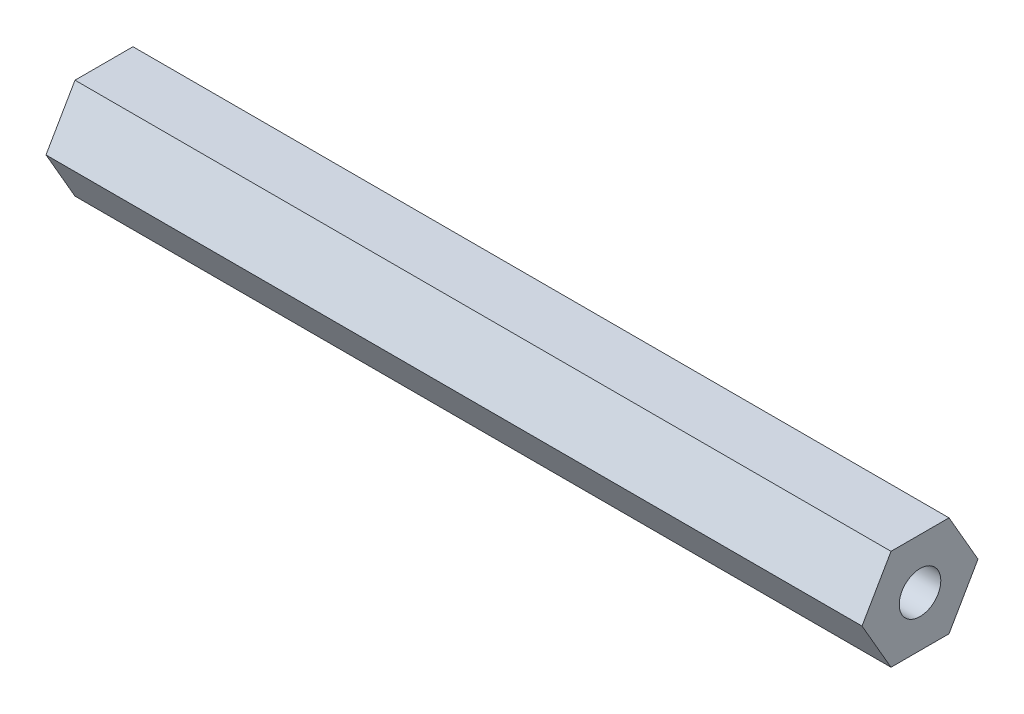
ISO-10303-21;
HEADER;
FILE_DESCRIPTION(('STEP AP214'),'2;1');
FILE_NAME('part.step','',(''),(''),'','','');
FILE_SCHEMA(('AUTOMOTIVE_DESIGN { 1 0 10303 214 1 1 1 1 }'));
ENDSEC;
DATA;
#1=APPLICATION_CONTEXT('core data for automotive mechanical design processes');
#2=APPLICATION_PROTOCOL_DEFINITION('international standard','automotive_design',2000,#1);
#3=PRODUCT_CONTEXT('',#1,'mechanical');
#4=PRODUCT('Part','Part','',(#3));
#5=PRODUCT_RELATED_PRODUCT_CATEGORY('part','',(#4));
#6=PRODUCT_DEFINITION_FORMATION('','',#4);
#7=PRODUCT_DEFINITION_CONTEXT('part definition',#1,'design');
#8=PRODUCT_DEFINITION('design','',#6,#7);
#9=PRODUCT_DEFINITION_SHAPE('','',#8);
#10=(LENGTH_UNIT() NAMED_UNIT(*) SI_UNIT(.MILLI.,.METRE.));
#11=(NAMED_UNIT(*) PLANE_ANGLE_UNIT() SI_UNIT($,.RADIAN.));
#12=(NAMED_UNIT(*) SI_UNIT($,.STERADIAN.) SOLID_ANGLE_UNIT());
#13=UNCERTAINTY_MEASURE_WITH_UNIT(LENGTH_MEASURE(1.E-05),#10,'distance_accuracy_value','');
#14=(GEOMETRIC_REPRESENTATION_CONTEXT(3) GLOBAL_UNCERTAINTY_ASSIGNED_CONTEXT((#13)) GLOBAL_UNIT_ASSIGNED_CONTEXT((#10,
#11,#12)) REPRESENTATION_CONTEXT('',''));
#15=CARTESIAN_POINT('',(0.,0.,0.));
#16=DIRECTION('',(0.,0.,1.));
#17=DIRECTION('',(1.,0.,0.));
#18=AXIS2_PLACEMENT_3D('',#15,#16,#17);
#19=CARTESIAN_POINT('',(103.1875,0.,0.));
#20=DIRECTION('',(1.,0.,0.));
#21=DIRECTION('',(0.,0.,-1.));
#22=AXIS2_PLACEMENT_3D('',#19,#20,#21);
#23=PLANE('',#22);
#24=DIRECTION('',(0.,0.866025403784439,0.5));
#25=VECTOR('',#24,1.);
#26=CARTESIAN_POINT('',(103.1875,0.,-7.33234841870825));
#27=LINE('',#26,#25);
#28=CARTESIAN_POINT('',(103.1875,0.,-7.33234841870825));
#29=VERTEX_POINT('',#28);
#30=CARTESIAN_POINT('',(103.1875,6.35,-3.66617420935412));
#31=VERTEX_POINT('',#30);
#32=EDGE_CURVE('E146',#29,#31,#27,.T.);
#33=ORIENTED_EDGE('',*,*,#32,.T.);
#34=DIRECTION('',(0.,0.,1.));
#35=VECTOR('',#34,1.);
#36=CARTESIAN_POINT('',(103.1875,6.35,-3.66617420935412));
#37=LINE('',#36,#35);
#38=CARTESIAN_POINT('',(103.1875,6.35,3.66617420935412));
#39=VERTEX_POINT('',#38);
#40=EDGE_CURVE('E94',#31,#39,#37,.T.);
#41=ORIENTED_EDGE('',*,*,#40,.T.);
#42=DIRECTION('',(0.,-0.866025403784439,0.5));
#43=VECTOR('',#42,1.);
#44=CARTESIAN_POINT('',(103.1875,6.35,3.66617420935412));
#45=LINE('',#44,#43);
#46=CARTESIAN_POINT('',(103.1875,0.,7.33234841870824));
#47=VERTEX_POINT('',#46);
#48=EDGE_CURVE('E107',#39,#47,#45,.T.);
#49=ORIENTED_EDGE('',*,*,#48,.T.);
#50=DIRECTION('',(0.,-0.866025403784439,-0.5));
#51=VECTOR('',#50,1.);
#52=CARTESIAN_POINT('',(103.1875,0.,7.33234841870824));
#53=LINE('',#52,#51);
#54=CARTESIAN_POINT('',(103.1875,-6.35,3.66617420935412));
#55=VERTEX_POINT('',#54);
#56=EDGE_CURVE('E101',#47,#55,#53,.T.);
#57=ORIENTED_EDGE('',*,*,#56,.T.);
#58=DIRECTION('',(0.,0.,-1.));
#59=VECTOR('',#58,1.);
#60=CARTESIAN_POINT('',(103.1875,-6.35,3.66617420935412));
#61=LINE('',#60,#59);
#62=CARTESIAN_POINT('',(103.1875,-6.35,-3.66617420935412));
#63=VERTEX_POINT('',#62);
#64=EDGE_CURVE('E105',#55,#63,#61,.T.);
#65=ORIENTED_EDGE('',*,*,#64,.T.);
#66=DIRECTION('',(0.,0.866025403784439,-0.5));
#67=VECTOR('',#66,1.);
#68=CARTESIAN_POINT('',(103.1875,-6.35,-3.66617420935412));
#69=LINE('',#68,#67);
#70=EDGE_CURVE('E57',#63,#29,#69,.T.);
#71=ORIENTED_EDGE('',*,*,#70,.T.);
#72=EDGE_LOOP('',(#33,#41,#49,#57,#65,#71));
#73=FACE_BOUND('',#72,.T.);
#74=CARTESIAN_POINT('',(103.1875,0.,0.));
#75=DIRECTION('',(1.,0.,0.));
#76=DIRECTION('',(0.,0.,-1.));
#77=AXIS2_PLACEMENT_3D('',#74,#75,#76);
#78=CIRCLE('',#77,2.6289);
#79=CARTESIAN_POINT('',(103.1875,0.,-2.6289));
#80=VERTEX_POINT('',#79);
#81=EDGE_CURVE('E134',#80,#80,#78,.T.);
#82=ORIENTED_EDGE('',*,*,#81,.F.);
#83=EDGE_LOOP('',(#82));
#84=FACE_BOUND('',#83,.T.);
#85=ADVANCED_FACE('F39',(#73,#84),#23,.T.);
#86=CARTESIAN_POINT('',(0.,0.,0.));
#87=DIRECTION('',(1.,0.,0.));
#88=DIRECTION('',(0.,0.,-1.));
#89=AXIS2_PLACEMENT_3D('',#86,#87,#88);
#90=PLANE('',#89);
#91=DIRECTION('',(0.,0.866025403784439,0.5));
#92=VECTOR('',#91,1.);
#93=CARTESIAN_POINT('',(0.,0.,-7.33234841870825));
#94=LINE('',#93,#92);
#95=CARTESIAN_POINT('',(0.,0.,-7.33234841870825));
#96=VERTEX_POINT('',#95);
#97=CARTESIAN_POINT('',(0.,6.35,-3.66617420935412));
#98=VERTEX_POINT('',#97);
#99=EDGE_CURVE('E129',#96,#98,#94,.T.);
#100=ORIENTED_EDGE('',*,*,#99,.F.);
#101=DIRECTION('',(0.,0.866025403784439,-0.5));
#102=VECTOR('',#101,1.);
#103=CARTESIAN_POINT('',(0.,-6.35,-3.66617420935412));
#104=LINE('',#103,#102);
#105=CARTESIAN_POINT('',(0.,-6.35,-3.66617420935412));
#106=VERTEX_POINT('',#105);
#107=EDGE_CURVE('E86',#106,#96,#104,.T.);
#108=ORIENTED_EDGE('',*,*,#107,.F.);
#109=DIRECTION('',(0.,0.,-1.));
#110=VECTOR('',#109,1.);
#111=CARTESIAN_POINT('',(0.,-6.35,3.66617420935412));
#112=LINE('',#111,#110);
#113=CARTESIAN_POINT('',(0.,-6.35,3.66617420935412));
#114=VERTEX_POINT('',#113);
#115=EDGE_CURVE('E80',#114,#106,#112,.T.);
#116=ORIENTED_EDGE('',*,*,#115,.F.);
#117=DIRECTION('',(0.,-0.866025403784439,-0.5));
#118=VECTOR('',#117,1.);
#119=CARTESIAN_POINT('',(0.,0.,7.33234841870824));
#120=LINE('',#119,#118);
#121=CARTESIAN_POINT('',(0.,0.,7.33234841870824));
#122=VERTEX_POINT('',#121);
#123=EDGE_CURVE('E116',#122,#114,#120,.T.);
#124=ORIENTED_EDGE('',*,*,#123,.F.);
#125=DIRECTION('',(0.,-0.866025403784439,0.5));
#126=VECTOR('',#125,1.);
#127=CARTESIAN_POINT('',(0.,6.35,3.66617420935412));
#128=LINE('',#127,#126);
#129=CARTESIAN_POINT('',(0.,6.35,3.66617420935412));
#130=VERTEX_POINT('',#129);
#131=EDGE_CURVE('E137',#130,#122,#128,.T.);
#132=ORIENTED_EDGE('',*,*,#131,.F.);
#133=DIRECTION('',(0.,0.,1.));
#134=VECTOR('',#133,1.);
#135=CARTESIAN_POINT('',(0.,6.35,-3.66617420935412));
#136=LINE('',#135,#134);
#137=EDGE_CURVE('E133',#98,#130,#136,.T.);
#138=ORIENTED_EDGE('',*,*,#137,.F.);
#139=EDGE_LOOP('',(#100,#108,#116,#124,#132,#138));
#140=FACE_BOUND('',#139,.T.);
#141=CARTESIAN_POINT('',(0.,0.,0.));
#142=DIRECTION('',(1.,0.,0.));
#143=DIRECTION('',(0.,0.,-1.));
#144=AXIS2_PLACEMENT_3D('',#141,#142,#143);
#145=CIRCLE('',#144,2.6289);
#146=CARTESIAN_POINT('',(0.,0.,-2.6289));
#147=VERTEX_POINT('',#146);
#148=EDGE_CURVE('E243',#147,#147,#145,.T.);
#149=ORIENTED_EDGE('',*,*,#148,.T.);
#150=EDGE_LOOP('',(#149));
#151=FACE_BOUND('',#150,.T.);
#152=ADVANCED_FACE('F159',(#140,#151),#90,.F.);
#153=CARTESIAN_POINT('',(103.1875,0.,-7.33234841870825));
#154=DIRECTION('',(0.,-0.5,0.866025403784439));
#155=DIRECTION('',(0.,-0.866025403784439,-0.5));
#156=AXIS2_PLACEMENT_3D('',#153,#154,#155);
#157=PLANE('',#156);
#158=ORIENTED_EDGE('',*,*,#99,.T.);
#159=DIRECTION('',(-1.,0.,0.));
#160=VECTOR('',#159,1.);
#161=CARTESIAN_POINT('',(103.1875,6.35,-3.66617420935412));
#162=LINE('',#161,#160);
#163=EDGE_CURVE('E11',#31,#98,#162,.T.);
#164=ORIENTED_EDGE('',*,*,#163,.F.);
#165=ORIENTED_EDGE('',*,*,#32,.F.);
#166=DIRECTION('',(-1.,0.,0.));
#167=VECTOR('',#166,1.);
#168=CARTESIAN_POINT('',(103.1875,0.,-7.33234841870825));
#169=LINE('',#168,#167);
#170=EDGE_CURVE('E125',#29,#96,#169,.T.);
#171=ORIENTED_EDGE('',*,*,#170,.T.);
#172=EDGE_LOOP('',(#158,#164,#165,#171));
#173=FACE_BOUND('',#172,.T.);
#174=ADVANCED_FACE('F41',(#173),#157,.F.);
#175=CARTESIAN_POINT('',(103.1875,6.35,-3.66617420935412));
#176=DIRECTION('',(0.,-1.,0.));
#177=DIRECTION('',(0.,0.,-1.));
#178=AXIS2_PLACEMENT_3D('',#175,#176,#177);
#179=PLANE('',#178);
#180=ORIENTED_EDGE('',*,*,#137,.T.);
#181=DIRECTION('',(-1.,0.,0.));
#182=VECTOR('',#181,1.);
#183=CARTESIAN_POINT('',(103.1875,6.35,3.66617420935412));
#184=LINE('',#183,#182);
#185=EDGE_CURVE('E49',#39,#130,#184,.T.);
#186=ORIENTED_EDGE('',*,*,#185,.F.);
#187=ORIENTED_EDGE('',*,*,#40,.F.);
#188=ORIENTED_EDGE('',*,*,#163,.T.);
#189=EDGE_LOOP('',(#180,#186,#187,#188));
#190=FACE_BOUND('',#189,.T.);
#191=ADVANCED_FACE('F184',(#190),#179,.F.);
#192=CARTESIAN_POINT('',(103.1875,6.35,3.66617420935412));
#193=DIRECTION('',(0.,-0.5,-0.866025403784439));
#194=DIRECTION('',(0.,0.866025403784439,-0.5));
#195=AXIS2_PLACEMENT_3D('',#192,#193,#194);
#196=PLANE('',#195);
#197=ORIENTED_EDGE('',*,*,#131,.T.);
#198=DIRECTION('',(-1.,0.,0.));
#199=VECTOR('',#198,1.);
#200=CARTESIAN_POINT('',(103.1875,0.,7.33234841870824));
#201=LINE('',#200,#199);
#202=EDGE_CURVE('E118',#47,#122,#201,.T.);
#203=ORIENTED_EDGE('',*,*,#202,.F.);
#204=ORIENTED_EDGE('',*,*,#48,.F.);
#205=ORIENTED_EDGE('',*,*,#185,.T.);
#206=EDGE_LOOP('',(#197,#203,#204,#205));
#207=FACE_BOUND('',#206,.T.);
#208=ADVANCED_FACE('F156',(#207),#196,.F.);
#209=CARTESIAN_POINT('',(103.1875,0.,7.33234841870824));
#210=DIRECTION('',(0.,0.5,-0.866025403784439));
#211=DIRECTION('',(0.,0.866025403784439,0.5));
#212=AXIS2_PLACEMENT_3D('',#209,#210,#211);
#213=PLANE('',#212);
#214=ORIENTED_EDGE('',*,*,#123,.T.);
#215=DIRECTION('',(-1.,0.,0.));
#216=VECTOR('',#215,1.);
#217=CARTESIAN_POINT('',(103.1875,-6.35,3.66617420935412));
#218=LINE('',#217,#216);
#219=EDGE_CURVE('E113',#55,#114,#218,.T.);
#220=ORIENTED_EDGE('',*,*,#219,.F.);
#221=ORIENTED_EDGE('',*,*,#56,.F.);
#222=ORIENTED_EDGE('',*,*,#202,.T.);
#223=EDGE_LOOP('',(#214,#220,#221,#222));
#224=FACE_BOUND('',#223,.T.);
#225=ADVANCED_FACE('F114',(#224),#213,.F.);
#226=CARTESIAN_POINT('',(103.1875,-6.35,3.66617420935412));
#227=DIRECTION('',(0.,1.,0.));
#228=DIRECTION('',(0.,0.,1.));
#229=AXIS2_PLACEMENT_3D('',#226,#227,#228);
#230=PLANE('',#229);
#231=ORIENTED_EDGE('',*,*,#115,.T.);
#232=DIRECTION('',(-1.,0.,0.));
#233=VECTOR('',#232,1.);
#234=CARTESIAN_POINT('',(103.1875,-6.35,-3.66617420935412));
#235=LINE('',#234,#233);
#236=EDGE_CURVE('E119',#63,#106,#235,.T.);
#237=ORIENTED_EDGE('',*,*,#236,.F.);
#238=ORIENTED_EDGE('',*,*,#64,.F.);
#239=ORIENTED_EDGE('',*,*,#219,.T.);
#240=EDGE_LOOP('',(#231,#237,#238,#239));
#241=FACE_BOUND('',#240,.T.);
#242=ADVANCED_FACE('F121',(#241),#230,.F.);
#243=CARTESIAN_POINT('',(103.1875,-6.35,-3.66617420935412));
#244=DIRECTION('',(0.,0.5,0.866025403784439));
#245=DIRECTION('',(0.,-0.866025403784439,0.5));
#246=AXIS2_PLACEMENT_3D('',#243,#244,#245);
#247=PLANE('',#246);
#248=ORIENTED_EDGE('',*,*,#107,.T.);
#249=ORIENTED_EDGE('',*,*,#170,.F.);
#250=ORIENTED_EDGE('',*,*,#70,.F.);
#251=ORIENTED_EDGE('',*,*,#236,.T.);
#252=EDGE_LOOP('',(#248,#249,#250,#251));
#253=FACE_BOUND('',#252,.T.);
#254=ADVANCED_FACE('F164',(#253),#247,.F.);
#255=CARTESIAN_POINT('',(103.1875,0.,0.));
#256=DIRECTION('',(-1.,0.,0.));
#257=DIRECTION('',(0.,0.,1.));
#258=AXIS2_PLACEMENT_3D('',#255,#256,#257);
#259=CYLINDRICAL_SURFACE('',#258,2.6289);
#260=ORIENTED_EDGE('',*,*,#81,.T.);
#261=EDGE_LOOP('',(#260));
#262=FACE_BOUND('',#261,.T.);
#263=ORIENTED_EDGE('',*,*,#148,.F.);
#264=EDGE_LOOP('',(#263));
#265=FACE_BOUND('',#264,.T.);
#266=ADVANCED_FACE('F166',(#262,#265),#259,.F.);
#267=CLOSED_SHELL('',(#85,#152,#174,#191,#208,#225,#242,#254,#266));
#268=MANIFOLD_SOLID_BREP('B2',#267);
#269=ADVANCED_BREP_SHAPE_REPRESENTATION('',(#18,#268),#14);
#270=SHAPE_DEFINITION_REPRESENTATION(#9,#269);
ENDSEC;
END-ISO-10303-21;
